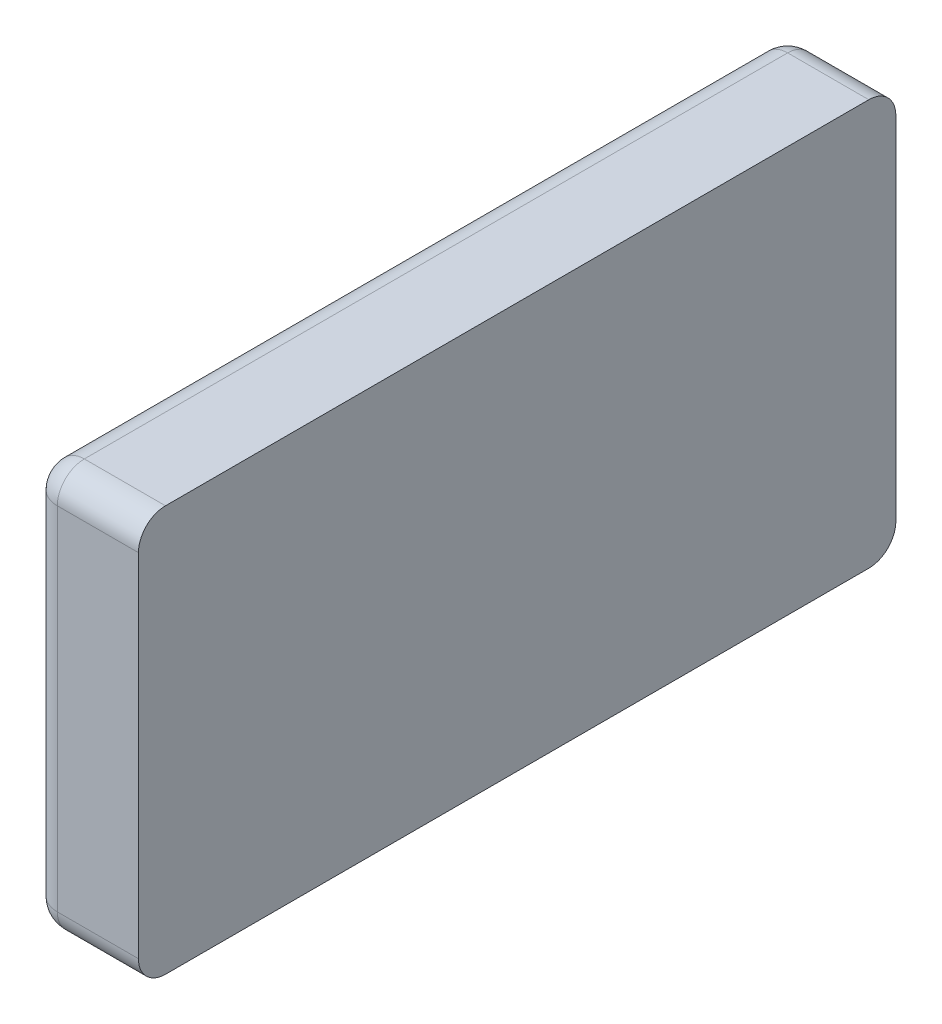
ISO-10303-21;
HEADER;
FILE_DESCRIPTION(('STEP AP214'),'2;1');
FILE_NAME('part.step','',(''),(''),'','','');
FILE_SCHEMA(('AUTOMOTIVE_DESIGN { 1 0 10303 214 1 1 1 1 }'));
ENDSEC;
DATA;
#1=APPLICATION_CONTEXT('core data for automotive mechanical design processes');
#2=APPLICATION_PROTOCOL_DEFINITION('international standard','automotive_design',2000,#1);
#3=PRODUCT_CONTEXT('',#1,'mechanical');
#4=PRODUCT('Part','Part','',(#3));
#5=PRODUCT_RELATED_PRODUCT_CATEGORY('part','',(#4));
#6=PRODUCT_DEFINITION_FORMATION('','',#4);
#7=PRODUCT_DEFINITION_CONTEXT('part definition',#1,'design');
#8=PRODUCT_DEFINITION('design','',#6,#7);
#9=PRODUCT_DEFINITION_SHAPE('','',#8);
#10=(LENGTH_UNIT() NAMED_UNIT(*) SI_UNIT(.MILLI.,.METRE.));
#11=(NAMED_UNIT(*) PLANE_ANGLE_UNIT() SI_UNIT($,.RADIAN.));
#12=(NAMED_UNIT(*) SI_UNIT($,.STERADIAN.) SOLID_ANGLE_UNIT());
#13=UNCERTAINTY_MEASURE_WITH_UNIT(LENGTH_MEASURE(1.E-05),#10,'distance_accuracy_value','');
#14=(GEOMETRIC_REPRESENTATION_CONTEXT(3) GLOBAL_UNCERTAINTY_ASSIGNED_CONTEXT((#13)) GLOBAL_UNIT_ASSIGNED_CONTEXT((#10,
#11,#12)) REPRESENTATION_CONTEXT('',''));
#15=CARTESIAN_POINT('',(0.,0.,0.));
#16=DIRECTION('',(0.,0.,1.));
#17=DIRECTION('',(1.,0.,0.));
#18=AXIS2_PLACEMENT_3D('',#15,#16,#17);
#19=CARTESIAN_POINT('',(992.6,65.,632.51));
#20=DIRECTION('',(1.,0.,0.));
#21=DIRECTION('',(0.,0.,-1.));
#22=AXIS2_PLACEMENT_3D('',#19,#20,#21);
#23=CYLINDRICAL_SURFACE('',#22,10.);
#24=DIRECTION('',(1.,0.,0.));
#25=VECTOR('',#24,1.);
#26=CARTESIAN_POINT('',(992.6,65.,622.51));
#27=LINE('',#26,#25);
#28=CARTESIAN_POINT('',(1002.6,65.,622.51));
#29=VERTEX_POINT('',#28);
#30=CARTESIAN_POINT('',(1032.6,65.,622.51));
#31=VERTEX_POINT('',#30);
#32=EDGE_CURVE('E114',#29,#31,#27,.T.);
#33=ORIENTED_EDGE('',*,*,#32,.F.);
#34=CARTESIAN_POINT('',(1002.6,65.,632.51));
#35=DIRECTION('',(1.,0.,0.));
#36=DIRECTION('',(0.,0.,-1.));
#37=AXIS2_PLACEMENT_3D('',#34,#35,#36);
#38=CIRCLE('',#37,10.);
#39=CARTESIAN_POINT('',(1002.6,75.,632.51));
#40=VERTEX_POINT('',#39);
#41=EDGE_CURVE('E186',#29,#40,#38,.T.);
#42=ORIENTED_EDGE('',*,*,#41,.T.);
#43=DIRECTION('',(1.,0.,0.));
#44=VECTOR('',#43,1.);
#45=CARTESIAN_POINT('',(992.6,75.,632.51));
#46=LINE('',#45,#44);
#47=CARTESIAN_POINT('',(1032.6,75.,632.51));
#48=VERTEX_POINT('',#47);
#49=EDGE_CURVE('E137',#40,#48,#46,.T.);
#50=ORIENTED_EDGE('',*,*,#49,.T.);
#51=CARTESIAN_POINT('',(1032.6,65.,632.51));
#52=DIRECTION('',(-1.,0.,0.));
#53=DIRECTION('',(0.,0.,1.));
#54=AXIS2_PLACEMENT_3D('',#51,#52,#53);
#55=CIRCLE('',#54,10.);
#56=EDGE_CURVE('E132',#48,#31,#55,.T.);
#57=ORIENTED_EDGE('',*,*,#56,.T.);
#58=EDGE_LOOP('',(#33,#42,#50,#57));
#59=FACE_BOUND('',#58,.T.);
#60=ADVANCED_FACE('F36',(#59),#23,.T.);
#61=CARTESIAN_POINT('',(992.6,65.,622.51));
#62=DIRECTION('',(0.,0.,1.));
#63=DIRECTION('',(1.,0.,0.));
#64=AXIS2_PLACEMENT_3D('',#61,#62,#63);
#65=PLANE('',#64);
#66=DIRECTION('',(1.,0.,0.));
#67=VECTOR('',#66,1.);
#68=CARTESIAN_POINT('',(992.6,-65.,622.51));
#69=LINE('',#68,#67);
#70=CARTESIAN_POINT('',(1002.6,-65.,622.51));
#71=VERTEX_POINT('',#70);
#72=CARTESIAN_POINT('',(1032.6,-65.,622.51));
#73=VERTEX_POINT('',#72);
#74=EDGE_CURVE('E126',#71,#73,#69,.T.);
#75=ORIENTED_EDGE('',*,*,#74,.F.);
#76=DIRECTION('',(0.,-1.,0.));
#77=VECTOR('',#76,1.);
#78=CARTESIAN_POINT('',(1002.6,65.,622.51));
#79=LINE('',#78,#77);
#80=EDGE_CURVE('E121',#71,#29,#79,.F.);
#81=ORIENTED_EDGE('',*,*,#80,.T.);
#82=ORIENTED_EDGE('',*,*,#32,.T.);
#83=DIRECTION('',(0.,-1.,0.));
#84=VECTOR('',#83,1.);
#85=CARTESIAN_POINT('',(1032.6,65.,622.51));
#86=LINE('',#85,#84);
#87=EDGE_CURVE('E118',#31,#73,#86,.T.);
#88=ORIENTED_EDGE('',*,*,#87,.T.);
#89=EDGE_LOOP('',(#75,#81,#82,#88));
#90=FACE_BOUND('',#89,.T.);
#91=ADVANCED_FACE('F117',(#90),#65,.F.);
#92=CARTESIAN_POINT('',(992.6,-65.,632.51));
#93=DIRECTION('',(1.,0.,0.));
#94=DIRECTION('',(0.,0.,-1.));
#95=AXIS2_PLACEMENT_3D('',#92,#93,#94);
#96=CYLINDRICAL_SURFACE('',#95,10.);
#97=DIRECTION('',(1.,0.,0.));
#98=VECTOR('',#97,1.);
#99=CARTESIAN_POINT('',(992.6,-75.,632.51));
#100=LINE('',#99,#98);
#101=CARTESIAN_POINT('',(1002.6,-75.,632.51));
#102=VERTEX_POINT('',#101);
#103=CARTESIAN_POINT('',(1032.6,-75.,632.51));
#104=VERTEX_POINT('',#103);
#105=EDGE_CURVE('E167',#102,#104,#100,.T.);
#106=ORIENTED_EDGE('',*,*,#105,.F.);
#107=CARTESIAN_POINT('',(1002.6,-65.,632.51));
#108=DIRECTION('',(1.,0.,0.));
#109=DIRECTION('',(0.,0.,-1.));
#110=AXIS2_PLACEMENT_3D('',#107,#108,#109);
#111=CIRCLE('',#110,10.);
#112=EDGE_CURVE('E183',#102,#71,#111,.T.);
#113=ORIENTED_EDGE('',*,*,#112,.T.);
#114=ORIENTED_EDGE('',*,*,#74,.T.);
#115=CARTESIAN_POINT('',(1032.6,-65.,632.51));
#116=DIRECTION('',(-1.,0.,0.));
#117=DIRECTION('',(0.,0.,1.));
#118=AXIS2_PLACEMENT_3D('',#115,#116,#117);
#119=CIRCLE('',#118,10.);
#120=EDGE_CURVE('E135',#73,#104,#119,.T.);
#121=ORIENTED_EDGE('',*,*,#120,.T.);
#122=EDGE_LOOP('',(#106,#113,#114,#121));
#123=FACE_BOUND('',#122,.T.);
#124=ADVANCED_FACE('F246',(#123),#96,.T.);
#125=CARTESIAN_POINT('',(992.6,-75.,632.51));
#126=DIRECTION('',(0.,1.,0.));
#127=DIRECTION('',(0.,0.,1.));
#128=AXIS2_PLACEMENT_3D('',#125,#126,#127);
#129=PLANE('',#128);
#130=DIRECTION('',(1.,0.,0.));
#131=VECTOR('',#130,1.);
#132=CARTESIAN_POINT('',(992.6,-75.,892.51));
#133=LINE('',#132,#131);
#134=CARTESIAN_POINT('',(1002.6,-75.,892.51));
#135=VERTEX_POINT('',#134);
#136=CARTESIAN_POINT('',(1032.6,-75.,892.51));
#137=VERTEX_POINT('',#136);
#138=EDGE_CURVE('E165',#135,#137,#133,.T.);
#139=ORIENTED_EDGE('',*,*,#138,.F.);
#140=DIRECTION('',(0.,0.,1.));
#141=VECTOR('',#140,1.);
#142=CARTESIAN_POINT('',(1002.6,-75.,632.51));
#143=LINE('',#142,#141);
#144=EDGE_CURVE('E181',#135,#102,#143,.F.);
#145=ORIENTED_EDGE('',*,*,#144,.T.);
#146=ORIENTED_EDGE('',*,*,#105,.T.);
#147=DIRECTION('',(0.,0.,1.));
#148=VECTOR('',#147,1.);
#149=CARTESIAN_POINT('',(1032.6,-75.,632.51));
#150=LINE('',#149,#148);
#151=EDGE_CURVE('E144',#104,#137,#150,.T.);
#152=ORIENTED_EDGE('',*,*,#151,.T.);
#153=EDGE_LOOP('',(#139,#145,#146,#152));
#154=FACE_BOUND('',#153,.T.);
#155=ADVANCED_FACE('F347',(#154),#129,.F.);
#156=CARTESIAN_POINT('',(992.6,-65.,892.51));
#157=DIRECTION('',(1.,0.,0.));
#158=DIRECTION('',(0.,0.,-1.));
#159=AXIS2_PLACEMENT_3D('',#156,#157,#158);
#160=CYLINDRICAL_SURFACE('',#159,10.);
#161=DIRECTION('',(1.,0.,0.));
#162=VECTOR('',#161,1.);
#163=CARTESIAN_POINT('',(992.6,-65.,902.51));
#164=LINE('',#163,#162);
#165=CARTESIAN_POINT('',(1002.6,-65.,902.51));
#166=VERTEX_POINT('',#165);
#167=CARTESIAN_POINT('',(1032.6,-65.,902.51));
#168=VERTEX_POINT('',#167);
#169=EDGE_CURVE('E163',#166,#168,#164,.T.);
#170=ORIENTED_EDGE('',*,*,#169,.F.);
#171=CARTESIAN_POINT('',(1002.6,-65.,892.51));
#172=DIRECTION('',(1.,0.,0.));
#173=DIRECTION('',(0.,0.,-1.));
#174=AXIS2_PLACEMENT_3D('',#171,#172,#173);
#175=CIRCLE('',#174,10.);
#176=EDGE_CURVE('E125',#166,#135,#175,.T.);
#177=ORIENTED_EDGE('',*,*,#176,.T.);
#178=ORIENTED_EDGE('',*,*,#138,.T.);
#179=CARTESIAN_POINT('',(1032.6,-65.,892.51));
#180=DIRECTION('',(-1.,0.,0.));
#181=DIRECTION('',(0.,0.,1.));
#182=AXIS2_PLACEMENT_3D('',#179,#180,#181);
#183=CIRCLE('',#182,10.);
#184=EDGE_CURVE('E147',#137,#168,#183,.T.);
#185=ORIENTED_EDGE('',*,*,#184,.T.);
#186=EDGE_LOOP('',(#170,#177,#178,#185));
#187=FACE_BOUND('',#186,.T.);
#188=ADVANCED_FACE('F338',(#187),#160,.T.);
#189=CARTESIAN_POINT('',(992.6,-65.,902.51));
#190=DIRECTION('',(0.,0.,-1.));
#191=DIRECTION('',(-1.,0.,0.));
#192=AXIS2_PLACEMENT_3D('',#189,#190,#191);
#193=PLANE('',#192);
#194=DIRECTION('',(1.,0.,0.));
#195=VECTOR('',#194,1.);
#196=CARTESIAN_POINT('',(992.6,65.,902.51));
#197=LINE('',#196,#195);
#198=CARTESIAN_POINT('',(1002.6,65.,902.51));
#199=VERTEX_POINT('',#198);
#200=CARTESIAN_POINT('',(1032.6,65.,902.51));
#201=VERTEX_POINT('',#200);
#202=EDGE_CURVE('E161',#199,#201,#197,.T.);
#203=ORIENTED_EDGE('',*,*,#202,.F.);
#204=DIRECTION('',(0.,1.,0.));
#205=VECTOR('',#204,1.);
#206=CARTESIAN_POINT('',(1002.6,-65.,902.51));
#207=LINE('',#206,#205);
#208=EDGE_CURVE('E11',#199,#166,#207,.F.);
#209=ORIENTED_EDGE('',*,*,#208,.T.);
#210=ORIENTED_EDGE('',*,*,#169,.T.);
#211=DIRECTION('',(0.,1.,0.));
#212=VECTOR('',#211,1.);
#213=CARTESIAN_POINT('',(1032.6,-65.,902.51));
#214=LINE('',#213,#212);
#215=EDGE_CURVE('E150',#168,#201,#214,.T.);
#216=ORIENTED_EDGE('',*,*,#215,.T.);
#217=EDGE_LOOP('',(#203,#209,#210,#216));
#218=FACE_BOUND('',#217,.T.);
#219=ADVANCED_FACE('F330',(#218),#193,.F.);
#220=CARTESIAN_POINT('',(992.6,65.,892.51));
#221=DIRECTION('',(1.,0.,0.));
#222=DIRECTION('',(0.,0.,-1.));
#223=AXIS2_PLACEMENT_3D('',#220,#221,#222);
#224=CYLINDRICAL_SURFACE('',#223,10.);
#225=DIRECTION('',(1.,0.,0.));
#226=VECTOR('',#225,1.);
#227=CARTESIAN_POINT('',(992.6,75.,892.51));
#228=LINE('',#227,#226);
#229=CARTESIAN_POINT('',(1002.6,75.,892.51));
#230=VERTEX_POINT('',#229);
#231=CARTESIAN_POINT('',(1032.6,75.,892.51));
#232=VERTEX_POINT('',#231);
#233=EDGE_CURVE('E159',#230,#232,#228,.T.);
#234=ORIENTED_EDGE('',*,*,#233,.F.);
#235=CARTESIAN_POINT('',(1002.6,65.,892.51));
#236=DIRECTION('',(1.,0.,0.));
#237=DIRECTION('',(0.,0.,-1.));
#238=AXIS2_PLACEMENT_3D('',#235,#236,#237);
#239=CIRCLE('',#238,10.);
#240=EDGE_CURVE('E45',#230,#199,#239,.T.);
#241=ORIENTED_EDGE('',*,*,#240,.T.);
#242=ORIENTED_EDGE('',*,*,#202,.T.);
#243=CARTESIAN_POINT('',(1032.6,65.,892.51));
#244=DIRECTION('',(-1.,0.,0.));
#245=DIRECTION('',(0.,0.,1.));
#246=AXIS2_PLACEMENT_3D('',#243,#244,#245);
#247=CIRCLE('',#246,10.);
#248=EDGE_CURVE('E153',#201,#232,#247,.T.);
#249=ORIENTED_EDGE('',*,*,#248,.T.);
#250=EDGE_LOOP('',(#234,#241,#242,#249));
#251=FACE_BOUND('',#250,.T.);
#252=ADVANCED_FACE('F322',(#251),#224,.T.);
#253=CARTESIAN_POINT('',(992.6,75.,892.51));
#254=DIRECTION('',(0.,-1.,0.));
#255=DIRECTION('',(0.,0.,-1.));
#256=AXIS2_PLACEMENT_3D('',#253,#254,#255);
#257=PLANE('',#256);
#258=ORIENTED_EDGE('',*,*,#49,.F.);
#259=DIRECTION('',(0.,0.,-1.));
#260=VECTOR('',#259,1.);
#261=CARTESIAN_POINT('',(1002.6,75.,892.51));
#262=LINE('',#261,#260);
#263=EDGE_CURVE('E60',#40,#230,#262,.F.);
#264=ORIENTED_EDGE('',*,*,#263,.T.);
#265=ORIENTED_EDGE('',*,*,#233,.T.);
#266=DIRECTION('',(0.,0.,-1.));
#267=VECTOR('',#266,1.);
#268=CARTESIAN_POINT('',(1032.6,75.,892.51));
#269=LINE('',#268,#267);
#270=EDGE_CURVE('E156',#232,#48,#269,.T.);
#271=ORIENTED_EDGE('',*,*,#270,.T.);
#272=EDGE_LOOP('',(#258,#264,#265,#271));
#273=FACE_BOUND('',#272,.T.);
#274=ADVANCED_FACE('F314',(#273),#257,.F.);
#275=CARTESIAN_POINT('',(992.6,65.,632.51));
#276=DIRECTION('',(-1.,0.,0.));
#277=DIRECTION('',(0.,0.,1.));
#278=AXIS2_PLACEMENT_3D('',#275,#276,#277);
#279=PLANE('',#278);
#280=DIRECTION('',(0.,-1.,0.));
#281=VECTOR('',#280,1.);
#282=CARTESIAN_POINT('',(992.6,-65.,632.51));
#283=LINE('',#282,#281);
#284=CARTESIAN_POINT('',(992.6,65.,632.51));
#285=VERTEX_POINT('',#284);
#286=CARTESIAN_POINT('',(992.6,-65.,632.51));
#287=VERTEX_POINT('',#286);
#288=EDGE_CURVE('E176',#285,#287,#283,.T.);
#289=ORIENTED_EDGE('',*,*,#288,.T.);
#290=DIRECTION('',(0.,0.,1.));
#291=VECTOR('',#290,1.);
#292=CARTESIAN_POINT('',(992.6,-65.,892.51));
#293=LINE('',#292,#291);
#294=CARTESIAN_POINT('',(992.6,-65.,892.51));
#295=VERTEX_POINT('',#294);
#296=EDGE_CURVE('E178',#287,#295,#293,.T.);
#297=ORIENTED_EDGE('',*,*,#296,.T.);
#298=DIRECTION('',(0.,1.,0.));
#299=VECTOR('',#298,1.);
#300=CARTESIAN_POINT('',(992.6,65.,892.51));
#301=LINE('',#300,#299);
#302=CARTESIAN_POINT('',(992.6,65.,892.51));
#303=VERTEX_POINT('',#302);
#304=EDGE_CURVE('E172',#295,#303,#301,.T.);
#305=ORIENTED_EDGE('',*,*,#304,.T.);
#306=DIRECTION('',(0.,0.,-1.));
#307=VECTOR('',#306,1.);
#308=CARTESIAN_POINT('',(992.6,65.,632.51));
#309=LINE('',#308,#307);
#310=EDGE_CURVE('E174',#303,#285,#309,.T.);
#311=ORIENTED_EDGE('',*,*,#310,.T.);
#312=EDGE_LOOP('',(#289,#297,#305,#311));
#313=FACE_BOUND('',#312,.T.);
#314=ADVANCED_FACE('F219',(#313),#279,.T.);
#315=CARTESIAN_POINT('',(1032.6,65.,632.51));
#316=DIRECTION('',(-1.,0.,0.));
#317=DIRECTION('',(0.,0.,1.));
#318=AXIS2_PLACEMENT_3D('',#315,#316,#317);
#319=PLANE('',#318);
#320=ORIENTED_EDGE('',*,*,#56,.F.);
#321=ORIENTED_EDGE('',*,*,#270,.F.);
#322=ORIENTED_EDGE('',*,*,#248,.F.);
#323=ORIENTED_EDGE('',*,*,#215,.F.);
#324=ORIENTED_EDGE('',*,*,#184,.F.);
#325=ORIENTED_EDGE('',*,*,#151,.F.);
#326=ORIENTED_EDGE('',*,*,#120,.F.);
#327=ORIENTED_EDGE('',*,*,#87,.F.);
#328=EDGE_LOOP('',(#320,#321,#322,#323,#324,#325,#326,#327));
#329=FACE_BOUND('',#328,.T.);
#330=ADVANCED_FACE('F130',(#329),#319,.F.);
#331=CARTESIAN_POINT('',(1002.6,65.,632.51));
#332=DIRECTION('',(-1.,0.,0.));
#333=DIRECTION('',(0.,0.,1.));
#334=AXIS2_PLACEMENT_3D('',#331,#332,#333);
#335=SPHERICAL_SURFACE('',#334,10.);
#336=CARTESIAN_POINT('',(1002.6,65.,632.51));
#337=DIRECTION('',(0.,0.,1.));
#338=DIRECTION('',(1.,0.,0.));
#339=AXIS2_PLACEMENT_3D('',#336,#337,#338);
#340=CIRCLE('',#339,10.);
#341=EDGE_CURVE('E141',#40,#285,#340,.T.);
#342=ORIENTED_EDGE('',*,*,#341,.F.);
#343=ORIENTED_EDGE('',*,*,#41,.F.);
#344=CARTESIAN_POINT('',(1002.6,65.,632.51));
#345=DIRECTION('',(0.,-1.,0.));
#346=DIRECTION('',(0.,0.,-1.));
#347=AXIS2_PLACEMENT_3D('',#344,#345,#346);
#348=CIRCLE('',#347,10.);
#349=EDGE_CURVE('E40',#285,#29,#348,.T.);
#350=ORIENTED_EDGE('',*,*,#349,.F.);
#351=EDGE_LOOP('',(#342,#343,#350));
#352=FACE_BOUND('',#351,.T.);
#353=ADVANCED_FACE('F38',(#352),#335,.T.);
#354=CARTESIAN_POINT('',(1002.6,65.,632.51));
#355=DIRECTION('',(0.,1.,0.));
#356=DIRECTION('',(0.,0.,1.));
#357=AXIS2_PLACEMENT_3D('',#354,#355,#356);
#358=CYLINDRICAL_SURFACE('',#357,10.);
#359=ORIENTED_EDGE('',*,*,#349,.T.);
#360=ORIENTED_EDGE('',*,*,#80,.F.);
#361=CARTESIAN_POINT('',(1002.6,-65.,632.51));
#362=DIRECTION('',(0.,-1.,0.));
#363=DIRECTION('',(0.,0.,-1.));
#364=AXIS2_PLACEMENT_3D('',#361,#362,#363);
#365=CIRCLE('',#364,10.);
#366=EDGE_CURVE('E203',#287,#71,#365,.T.);
#367=ORIENTED_EDGE('',*,*,#366,.F.);
#368=ORIENTED_EDGE('',*,*,#288,.F.);
#369=EDGE_LOOP('',(#359,#360,#367,#368));
#370=FACE_BOUND('',#369,.T.);
#371=ADVANCED_FACE('F216',(#370),#358,.T.);
#372=CARTESIAN_POINT('',(1002.6,65.,632.51));
#373=DIRECTION('',(0.,0.,1.));
#374=DIRECTION('',(1.,0.,0.));
#375=AXIS2_PLACEMENT_3D('',#372,#373,#374);
#376=CYLINDRICAL_SURFACE('',#375,10.);
#377=ORIENTED_EDGE('',*,*,#341,.T.);
#378=ORIENTED_EDGE('',*,*,#310,.F.);
#379=CARTESIAN_POINT('',(1002.6,65.,892.51));
#380=DIRECTION('',(0.,0.,1.));
#381=DIRECTION('',(1.,0.,0.));
#382=AXIS2_PLACEMENT_3D('',#379,#380,#381);
#383=CIRCLE('',#382,10.);
#384=EDGE_CURVE('E200',#230,#303,#383,.T.);
#385=ORIENTED_EDGE('',*,*,#384,.F.);
#386=ORIENTED_EDGE('',*,*,#263,.F.);
#387=EDGE_LOOP('',(#377,#378,#385,#386));
#388=FACE_BOUND('',#387,.T.);
#389=ADVANCED_FACE('F210',(#388),#376,.T.);
#390=CARTESIAN_POINT('',(1002.6,-65.,632.51));
#391=DIRECTION('',(-1.,0.,0.));
#392=DIRECTION('',(0.,0.,1.));
#393=AXIS2_PLACEMENT_3D('',#390,#391,#392);
#394=SPHERICAL_SURFACE('',#393,10.);
#395=ORIENTED_EDGE('',*,*,#366,.T.);
#396=ORIENTED_EDGE('',*,*,#112,.F.);
#397=CARTESIAN_POINT('',(1002.6,-65.,632.51));
#398=DIRECTION('',(0.,0.,1.));
#399=DIRECTION('',(1.,0.,0.));
#400=AXIS2_PLACEMENT_3D('',#397,#398,#399);
#401=CIRCLE('',#400,10.);
#402=EDGE_CURVE('E197',#287,#102,#401,.T.);
#403=ORIENTED_EDGE('',*,*,#402,.F.);
#404=EDGE_LOOP('',(#395,#396,#403));
#405=FACE_BOUND('',#404,.T.);
#406=ADVANCED_FACE('F231',(#405),#394,.T.);
#407=CARTESIAN_POINT('',(1002.6,65.,892.51));
#408=DIRECTION('',(-1.,0.,0.));
#409=DIRECTION('',(0.,0.,1.));
#410=AXIS2_PLACEMENT_3D('',#407,#408,#409);
#411=SPHERICAL_SURFACE('',#410,10.);
#412=ORIENTED_EDGE('',*,*,#240,.F.);
#413=ORIENTED_EDGE('',*,*,#384,.T.);
#414=CARTESIAN_POINT('',(1002.6,65.,892.51));
#415=DIRECTION('',(0.,-1.,0.));
#416=DIRECTION('',(0.,0.,-1.));
#417=AXIS2_PLACEMENT_3D('',#414,#415,#416);
#418=CIRCLE('',#417,10.);
#419=EDGE_CURVE('E194',#199,#303,#418,.T.);
#420=ORIENTED_EDGE('',*,*,#419,.F.);
#421=EDGE_LOOP('',(#412,#413,#420));
#422=FACE_BOUND('',#421,.T.);
#423=ADVANCED_FACE('F228',(#422),#411,.T.);
#424=CARTESIAN_POINT('',(1002.6,-65.,632.51));
#425=DIRECTION('',(0.,0.,-1.));
#426=DIRECTION('',(-1.,0.,0.));
#427=AXIS2_PLACEMENT_3D('',#424,#425,#426);
#428=CYLINDRICAL_SURFACE('',#427,10.);
#429=ORIENTED_EDGE('',*,*,#402,.T.);
#430=ORIENTED_EDGE('',*,*,#144,.F.);
#431=CARTESIAN_POINT('',(1002.6,-65.,892.51));
#432=DIRECTION('',(0.,0.,1.));
#433=DIRECTION('',(1.,0.,0.));
#434=AXIS2_PLACEMENT_3D('',#431,#432,#433);
#435=CIRCLE('',#434,10.);
#436=EDGE_CURVE('E192',#295,#135,#435,.T.);
#437=ORIENTED_EDGE('',*,*,#436,.F.);
#438=ORIENTED_EDGE('',*,*,#296,.F.);
#439=EDGE_LOOP('',(#429,#430,#437,#438));
#440=FACE_BOUND('',#439,.T.);
#441=ADVANCED_FACE('F230',(#440),#428,.T.);
#442=CARTESIAN_POINT('',(1002.6,65.,892.51));
#443=DIRECTION('',(0.,-1.,0.));
#444=DIRECTION('',(0.,0.,-1.));
#445=AXIS2_PLACEMENT_3D('',#442,#443,#444);
#446=CYLINDRICAL_SURFACE('',#445,10.);
#447=ORIENTED_EDGE('',*,*,#419,.T.);
#448=ORIENTED_EDGE('',*,*,#304,.F.);
#449=CARTESIAN_POINT('',(1002.6,-65.,892.51));
#450=DIRECTION('',(0.,-1.,0.));
#451=DIRECTION('',(0.,0.,-1.));
#452=AXIS2_PLACEMENT_3D('',#449,#450,#451);
#453=CIRCLE('',#452,10.);
#454=EDGE_CURVE('E190',#166,#295,#453,.T.);
#455=ORIENTED_EDGE('',*,*,#454,.F.);
#456=ORIENTED_EDGE('',*,*,#208,.F.);
#457=EDGE_LOOP('',(#447,#448,#455,#456));
#458=FACE_BOUND('',#457,.T.);
#459=ADVANCED_FACE('F224',(#458),#446,.T.);
#460=CARTESIAN_POINT('',(1002.6,-65.,892.51));
#461=DIRECTION('',(-1.,0.,0.));
#462=DIRECTION('',(0.,0.,1.));
#463=AXIS2_PLACEMENT_3D('',#460,#461,#462);
#464=SPHERICAL_SURFACE('',#463,10.);
#465=ORIENTED_EDGE('',*,*,#436,.T.);
#466=ORIENTED_EDGE('',*,*,#176,.F.);
#467=ORIENTED_EDGE('',*,*,#454,.T.);
#468=EDGE_LOOP('',(#465,#466,#467));
#469=FACE_BOUND('',#468,.T.);
#470=ADVANCED_FACE('F250',(#469),#464,.T.);
#471=CLOSED_SHELL('',(#60,#91,#124,#155,#188,#219,#252,#274,#314,#330,#353,#371,#389,#406,#423,
#441,#459,#470));
#472=MANIFOLD_SOLID_BREP('B2',#471);
#473=ADVANCED_BREP_SHAPE_REPRESENTATION('',(#18,#472),#14);
#474=SHAPE_DEFINITION_REPRESENTATION(#9,#473);
ENDSEC;
END-ISO-10303-21;
